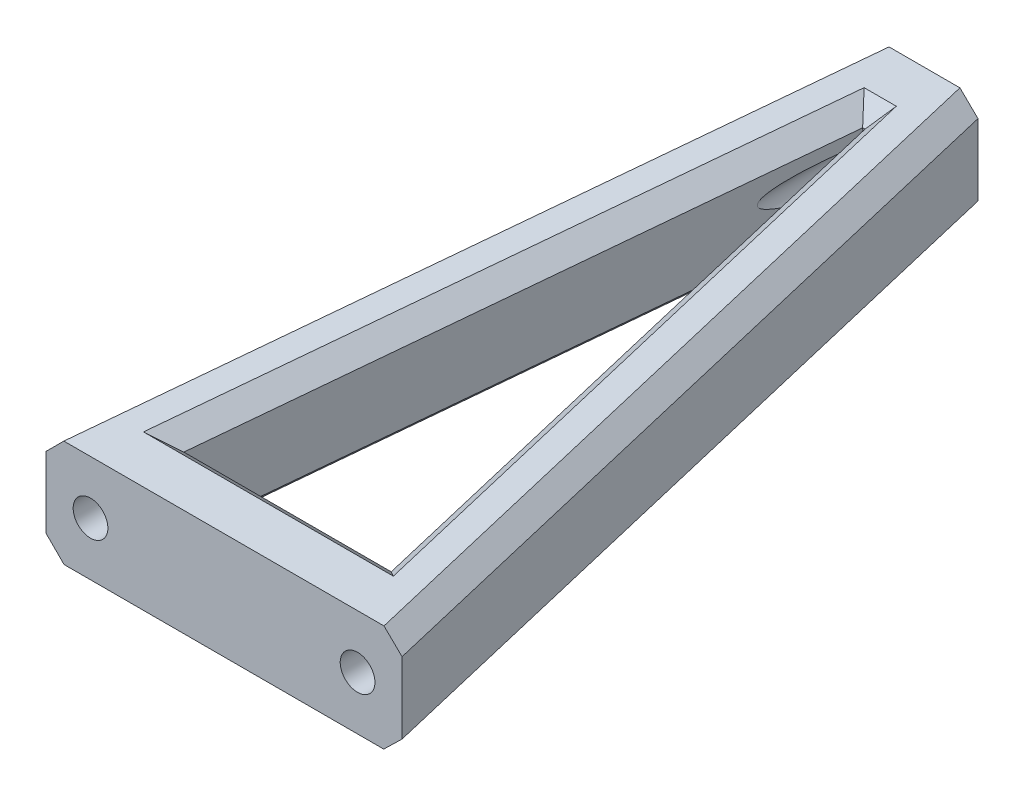
ISO-10303-21;
HEADER;
FILE_DESCRIPTION(('STEP AP214'),'2;1');
FILE_NAME('part.step','',(''),(''),'','','');
FILE_SCHEMA(('AUTOMOTIVE_DESIGN { 1 0 10303 214 1 1 1 1 }'));
ENDSEC;
DATA;
#1=APPLICATION_CONTEXT('core data for automotive mechanical design processes');
#2=APPLICATION_PROTOCOL_DEFINITION('international standard','automotive_design',2000,#1);
#3=PRODUCT_CONTEXT('',#1,'mechanical');
#4=PRODUCT('Part','Part','',(#3));
#5=PRODUCT_RELATED_PRODUCT_CATEGORY('part','',(#4));
#6=PRODUCT_DEFINITION_FORMATION('','',#4);
#7=PRODUCT_DEFINITION_CONTEXT('part definition',#1,'design');
#8=PRODUCT_DEFINITION('design','',#6,#7);
#9=PRODUCT_DEFINITION_SHAPE('','',#8);
#10=(LENGTH_UNIT() NAMED_UNIT(*) SI_UNIT(.MILLI.,.METRE.));
#11=(NAMED_UNIT(*) PLANE_ANGLE_UNIT() SI_UNIT($,.RADIAN.));
#12=(NAMED_UNIT(*) SI_UNIT($,.STERADIAN.) SOLID_ANGLE_UNIT());
#13=UNCERTAINTY_MEASURE_WITH_UNIT(LENGTH_MEASURE(1.E-05),#10,'distance_accuracy_value','');
#14=(GEOMETRIC_REPRESENTATION_CONTEXT(3) GLOBAL_UNCERTAINTY_ASSIGNED_CONTEXT((#13)) GLOBAL_UNIT_ASSIGNED_CONTEXT((#10,
#11,#12)) REPRESENTATION_CONTEXT('',''));
#15=CARTESIAN_POINT('',(0.,0.,0.));
#16=DIRECTION('',(0.,0.,1.));
#17=DIRECTION('',(1.,0.,0.));
#18=AXIS2_PLACEMENT_3D('',#15,#16,#17);
#19=CARTESIAN_POINT('',(0.,0.,78.7));
#20=DIRECTION('',(0.,0.,-1.));
#21=DIRECTION('',(-1.,0.,0.));
#22=AXIS2_PLACEMENT_3D('',#19,#20,#21);
#23=PLANE('',#22);
#24=CARTESIAN_POINT('',(15.,0.,78.7));
#25=DIRECTION('',(0.,0.,1.));
#26=DIRECTION('',(1.,0.,0.));
#27=AXIS2_PLACEMENT_3D('',#24,#25,#26);
#28=CIRCLE('',#27,1.95);
#29=CARTESIAN_POINT('',(16.95,0.,78.7));
#30=VERTEX_POINT('',#29);
#31=EDGE_CURVE('E829',#30,#30,#28,.T.);
#32=ORIENTED_EDGE('',*,*,#31,.F.);
#33=EDGE_LOOP('',(#32));
#34=FACE_BOUND('',#33,.T.);
#35=CARTESIAN_POINT('',(-15.,0.,78.7));
#36=DIRECTION('',(0.,0.,1.));
#37=DIRECTION('',(1.,0.,0.));
#38=AXIS2_PLACEMENT_3D('',#35,#36,#37);
#39=CIRCLE('',#38,1.95);
#40=CARTESIAN_POINT('',(-13.05,0.,78.7));
#41=VERTEX_POINT('',#40);
#42=EDGE_CURVE('E835',#41,#41,#39,.T.);
#43=ORIENTED_EDGE('',*,*,#42,.F.);
#44=EDGE_LOOP('',(#43));
#45=FACE_BOUND('',#44,.T.);
#46=DIRECTION('',(1.,0.,0.));
#47=VECTOR('',#46,1.);
#48=CARTESIAN_POINT('',(-20.,-6.,78.7));
#49=LINE('',#48,#47);
#50=CARTESIAN_POINT('',(-17.9687814103902,-6.,78.7));
#51=VERTEX_POINT('',#50);
#52=CARTESIAN_POINT('',(17.9411880570613,-6.,78.7));
#53=VERTEX_POINT('',#52);
#54=EDGE_CURVE('E249',#51,#53,#49,.T.);
#55=ORIENTED_EDGE('',*,*,#54,.T.);
#56=DIRECTION('',(-0.716298402373923,-0.697794094813481,0.));
#57=VECTOR('',#56,1.);
#58=CARTESIAN_POINT('',(13.6663660337412,-10.1643895258812,78.7));
#59=LINE('',#58,#57);
#60=CARTESIAN_POINT('',(20.,-3.99437383728219,78.7));
#61=VERTEX_POINT('',#60);
#62=EDGE_CURVE('E335',#53,#61,#59,.F.);
#63=ORIENTED_EDGE('',*,*,#62,.T.);
#64=DIRECTION('',(0.,1.,0.));
#65=VECTOR('',#64,1.);
#66=CARTESIAN_POINT('',(20.,-6.,78.7));
#67=LINE('',#66,#65);
#68=CARTESIAN_POINT('',(20.,4.02055260865113,78.7));
#69=VERTEX_POINT('',#68);
#70=EDGE_CURVE('E419',#61,#69,#67,.T.);
#71=ORIENTED_EDGE('',*,*,#70,.T.);
#72=DIRECTION('',(0.716174719545641,-0.697921034991583,0.));
#73=VECTOR('',#72,1.);
#74=CARTESIAN_POINT('',(9.91556076753506,13.8479621420354,78.7));
#75=LINE('',#74,#73);
#76=CARTESIAN_POINT('',(17.9687814103902,6.,78.7));
#77=VERTEX_POINT('',#76);
#78=EDGE_CURVE('E324',#69,#77,#75,.F.);
#79=ORIENTED_EDGE('',*,*,#78,.T.);
#80=DIRECTION('',(-1.,0.,0.));
#81=VECTOR('',#80,1.);
#82=CARTESIAN_POINT('',(-20.,6.,78.7));
#83=LINE('',#82,#81);
#84=CARTESIAN_POINT('',(-17.9952942311971,6.,78.7));
#85=VERTEX_POINT('',#84);
#86=EDGE_CURVE('E409',#77,#85,#83,.T.);
#87=ORIENTED_EDGE('',*,*,#86,.T.);
#88=DIRECTION('',(0.706944477552924,0.707269047574841,0.));
#89=VECTOR('',#88,1.);
#90=CARTESIAN_POINT('',(-7.78080469823353,16.2191791757811,78.7));
#91=LINE('',#90,#89);
#92=CARTESIAN_POINT('',(-20.,3.99437383728218,78.7));
#93=VERTEX_POINT('',#92);
#94=EDGE_CURVE('E326',#85,#93,#91,.F.);
#95=ORIENTED_EDGE('',*,*,#94,.T.);
#96=DIRECTION('',(0.,-1.,0.));
#97=VECTOR('',#96,1.);
#98=CARTESIAN_POINT('',(-20.,-6.,78.7));
#99=LINE('',#98,#97);
#100=CARTESIAN_POINT('',(-20.,-3.96712814760769,78.7));
#101=VERTEX_POINT('',#100);
#102=EDGE_CURVE('E320',#93,#101,#99,.T.);
#103=ORIENTED_EDGE('',*,*,#102,.T.);
#104=DIRECTION('',(-0.706819073266518,0.707394372091453,0.));
#105=VECTOR('',#104,1.);
#106=CARTESIAN_POINT('',(-15.9685198712556,-8.00188960515107,78.7));
#107=LINE('',#106,#105);
#108=EDGE_CURVE('E331',#101,#51,#107,.F.);
#109=ORIENTED_EDGE('',*,*,#108,.T.);
#110=EDGE_LOOP('',(#55,#63,#71,#79,#87,#95,#103,#109));
#111=FACE_BOUND('',#110,.T.);
#112=ADVANCED_FACE('F99',(#34,#45,#111),#23,.F.);
#113=CARTESIAN_POINT('',(0.,0.,0.));
#114=DIRECTION('',(0.,0.,1.));
#115=DIRECTION('',(1.,0.,0.));
#116=AXIS2_PLACEMENT_3D('',#113,#114,#115);
#117=PLANE('',#116);
#118=CARTESIAN_POINT('',(0.,6.,0.));
#119=DIRECTION('',(0.,0.,-1.));
#120=DIRECTION('',(-1.,0.,0.));
#121=AXIS2_PLACEMENT_3D('',#118,#119,#120);
#122=CIRCLE('',#121,1.95);
#123=CARTESIAN_POINT('',(-1.95,6.,0.));
#124=VERTEX_POINT('',#123);
#125=EDGE_CURVE('E540',#124,#124,#122,.T.);
#126=ORIENTED_EDGE('',*,*,#125,.F.);
#127=EDGE_LOOP('',(#126));
#128=FACE_BOUND('',#127,.T.);
#129=DIRECTION('',(0.,1.,0.));
#130=VECTOR('',#129,1.);
#131=CARTESIAN_POINT('',(6.,12.,0.));
#132=LINE('',#131,#130);
#133=CARTESIAN_POINT('',(6.,2.00562616271781,0.));
#134=VERTEX_POINT('',#133);
#135=CARTESIAN_POINT('',(6.,10.0205526086511,0.));
#136=VERTEX_POINT('',#135);
#137=EDGE_CURVE('E347',#134,#136,#132,.T.);
#138=ORIENTED_EDGE('',*,*,#137,.F.);
#139=DIRECTION('',(0.716298402373923,0.697794094813481,0.));
#140=VECTOR('',#139,1.);
#141=CARTESIAN_POINT('',(3.85056087934412,-0.08828598420862,0.));
#142=LINE('',#141,#140);
#143=CARTESIAN_POINT('',(3.94118805706128,0.,0.));
#144=VERTEX_POINT('',#143);
#145=EDGE_CURVE('E491',#134,#144,#142,.F.);
#146=ORIENTED_EDGE('',*,*,#145,.T.);
#147=DIRECTION('',(1.,0.,0.));
#148=VECTOR('',#147,1.);
#149=CARTESIAN_POINT('',(-6.,0.,0.));
#150=LINE('',#149,#148);
#151=CARTESIAN_POINT('',(-3.96878141039019,0.,0.));
#152=VERTEX_POINT('',#151);
#153=EDGE_CURVE('E266',#152,#144,#150,.T.);
#154=ORIENTED_EDGE('',*,*,#153,.F.);
#155=DIRECTION('',(0.706819073266518,-0.707394372091453,0.));
#156=VECTOR('',#155,1.);
#157=CARTESIAN_POINT('',(-5.96282569682862,1.99566729206779,0.));
#158=LINE('',#157,#156);
#159=CARTESIAN_POINT('',(-6.,2.0328718523923,0.));
#160=VERTEX_POINT('',#159);
#161=EDGE_CURVE('E487',#152,#160,#158,.F.);
#162=ORIENTED_EDGE('',*,*,#161,.T.);
#163=DIRECTION('',(0.,-1.,0.));
#164=VECTOR('',#163,1.);
#165=CARTESIAN_POINT('',(-6.,12.,0.));
#166=LINE('',#165,#164);
#167=CARTESIAN_POINT('',(-6.,9.99437383728218,0.));
#168=VERTEX_POINT('',#167);
#169=EDGE_CURVE('E456',#168,#160,#166,.T.);
#170=ORIENTED_EDGE('',*,*,#169,.F.);
#171=DIRECTION('',(-0.706944477552924,-0.707269047574841,0.));
#172=VECTOR('',#171,1.);
#173=CARTESIAN_POINT('',(-3.77759130299252,12.2178028792565,0.));
#174=LINE('',#173,#172);
#175=CARTESIAN_POINT('',(-3.99529423119708,12.,0.));
#176=VERTEX_POINT('',#175);
#177=EDGE_CURVE('E482',#168,#176,#174,.F.);
#178=ORIENTED_EDGE('',*,*,#177,.T.);
#179=DIRECTION('',(-1.,0.,0.));
#180=VECTOR('',#179,1.);
#181=CARTESIAN_POINT('',(-6.,12.,0.));
#182=LINE('',#181,#180);
#183=CARTESIAN_POINT('',(3.96878141039018,12.,0.));
#184=VERTEX_POINT('',#183);
#185=EDGE_CURVE('E460',#184,#176,#182,.T.);
#186=ORIENTED_EDGE('',*,*,#185,.F.);
#187=DIRECTION('',(-0.716174719545641,0.697921034991583,0.));
#188=VECTOR('',#187,1.);
#189=CARTESIAN_POINT('',(6.09524838136356,9.92773189453167,0.));
#190=LINE('',#189,#188);
#191=EDGE_CURVE('E424',#184,#136,#190,.F.);
#192=ORIENTED_EDGE('',*,*,#191,.T.);
#193=EDGE_LOOP('',(#138,#146,#154,#162,#170,#178,#186,#192));
#194=FACE_BOUND('',#193,.T.);
#195=ADVANCED_FACE('F374',(#128,#194),#117,.F.);
#196=CARTESIAN_POINT('',(6.,12.,0.));
#197=DIRECTION('',(0.,0.997106424250026,0.0760182788500655));
#198=DIRECTION('',(-1.,0.,0.));
#199=AXIS2_PLACEMENT_3D('',#196,#197,#198);
#200=PLANE('',#199);
#201=DIRECTION('',(0.174649823402375,-0.0748499243153034,0.981781507269063));
#202=VECTOR('',#201,1.);
#203=CARTESIAN_POINT('',(13.618364269534,6.55868110990349,71.3719661084325));
#204=LINE('',#203,#202);
#205=CARTESIAN_POINT('',(1.80883344589291,11.6199086057497,4.98553212125014));
#206=VERTEX_POINT('',#205);
#207=CARTESIAN_POINT('',(14.035073606058,6.38009139425033,73.7144678787499));
#208=VERTEX_POINT('',#207);
#209=EDGE_CURVE('E117',#206,#208,#204,.T.);
#210=ORIENTED_EDGE('',*,*,#209,.T.);
#211=DIRECTION('',(-1.,0.,0.));
#212=VECTOR('',#211,1.);
#213=CARTESIAN_POINT('',(-11.6491030484813,6.38009139425033,73.7144678787499));
#214=LINE('',#213,#212);
#215=CARTESIAN_POINT('',(-14.035073606058,6.38009139425033,73.7144678787499));
#216=VERTEX_POINT('',#215);
#217=EDGE_CURVE('E425',#208,#216,#214,.T.);
#218=ORIENTED_EDGE('',*,*,#217,.T.);
#219=DIRECTION('',(0.174649823402374,0.0748499243153034,-0.981781507269063));
#220=VECTOR('',#219,1.);
#221=CARTESIAN_POINT('',(-2.10162804530281,11.4944252060026,6.63145604793291));
#222=LINE('',#221,#220);
#223=CARTESIAN_POINT('',(-1.80883344589291,11.6199086057497,4.98553212125014));
#224=VERTEX_POINT('',#223);
#225=EDGE_CURVE('E521',#216,#224,#222,.T.);
#226=ORIENTED_EDGE('',*,*,#225,.T.);
#227=DIRECTION('',(1.,0.,0.));
#228=VECTOR('',#227,1.);
#229=CARTESIAN_POINT('',(0.13236682425009,11.6199086057497,4.98553212125014));
#230=LINE('',#229,#228);
#231=EDGE_CURVE('E517',#224,#206,#230,.T.);
#232=ORIENTED_EDGE('',*,*,#231,.T.);
#233=EDGE_LOOP('',(#210,#218,#226,#232));
#234=FACE_BOUND('',#233,.T.);
#235=ORIENTED_EDGE('',*,*,#185,.T.);
#236=DIRECTION('',(-0.174649823402374,-0.0748499243153034,0.981781507269063));
#237=VECTOR('',#236,1.);
#238=CARTESIAN_POINT('',(-3.69041216105136,12.1306637443482,-1.71387278003342));
#239=LINE('',#238,#237);
#240=EDGE_CURVE('E109',#176,#85,#239,.T.);
#241=ORIENTED_EDGE('',*,*,#240,.T.);
#242=ORIENTED_EDGE('',*,*,#86,.F.);
#243=DIRECTION('',(-0.174649823402375,0.0748499243153034,-0.981781507269063));
#244=VECTOR('',#243,1.);
#245=CARTESIAN_POINT('',(4.03073877894725,11.973446842047,0.348288921817284));
#246=LINE('',#245,#244);
#247=EDGE_CURVE('E416',#77,#184,#246,.T.);
#248=ORIENTED_EDGE('',*,*,#247,.T.);
#249=EDGE_LOOP('',(#235,#241,#242,#248));
#250=FACE_BOUND('',#249,.T.);
#251=ADVANCED_FACE('F365',(#234,#250),#200,.T.);
#252=CARTESIAN_POINT('',(6.,0.,0.));
#253=DIRECTION('',(0.984543338525678,0.,-0.175141127564924));
#254=DIRECTION('',(0.,1.,0.));
#255=AXIS2_PLACEMENT_3D('',#252,#253,#254);
#256=PLANE('',#255);
#257=ORIENTED_EDGE('',*,*,#70,.F.);
#258=DIRECTION('',(-0.174649823402375,0.0748499243153034,-0.981781507269063));
#259=VECTOR('',#258,1.);
#260=CARTESIAN_POINT('',(6.02621860028546,1.99438961973833,0.147385988747567));
#261=LINE('',#260,#259);
#262=EDGE_CURVE('E483',#61,#134,#261,.T.);
#263=ORIENTED_EDGE('',*,*,#262,.T.);
#264=ORIENTED_EDGE('',*,*,#137,.T.);
#265=DIRECTION('',(0.174649823402375,-0.0748499243153034,0.981781507269063));
#266=VECTOR('',#265,1.);
#267=CARTESIAN_POINT('',(6.13099393514575,9.96441235073152,0.736373049712181));
#268=LINE('',#267,#266);
#269=EDGE_CURVE('E339',#136,#69,#268,.T.);
#270=ORIENTED_EDGE('',*,*,#269,.T.);
#271=EDGE_LOOP('',(#257,#263,#264,#270));
#272=FACE_BOUND('',#271,.T.);
#273=ADVANCED_FACE('F292',(#272),#256,.T.);
#274=CARTESIAN_POINT('',(-6.,0.,0.));
#275=DIRECTION('',(0.,-0.997106424250026,-0.0760182788500655));
#276=DIRECTION('',(1.,0.,0.));
#277=AXIS2_PLACEMENT_3D('',#274,#275,#276);
#278=PLANE('',#277);
#279=DIRECTION('',(-0.174649823402375,0.0748499243153034,-0.981781507269063));
#280=VECTOR('',#279,1.);
#281=CARTESIAN_POINT('',(2.10162804530281,-0.436229449365509,5.72187627751093));
#282=LINE('',#281,#280);
#283=CARTESIAN_POINT('',(14.0350736060581,-5.55056326111775,72.8048881083279));
#284=VERTEX_POINT('',#283);
#285=CARTESIAN_POINT('',(1.80883344589292,-0.310746049618412,4.07595235082816));
#286=VERTEX_POINT('',#285);
#287=EDGE_CURVE('E550',#284,#286,#282,.T.);
#288=ORIENTED_EDGE('',*,*,#287,.T.);
#289=DIRECTION('',(-1.,0.,0.));
#290=VECTOR('',#289,1.);
#291=CARTESIAN_POINT('',(-0.132366824250091,-0.310746049618412,4.07595235082816));
#292=LINE('',#291,#290);
#293=CARTESIAN_POINT('',(-1.80883344589292,-0.310746049618412,4.07595235082816));
#294=VERTEX_POINT('',#293);
#295=EDGE_CURVE('E547',#286,#294,#292,.T.);
#296=ORIENTED_EDGE('',*,*,#295,.T.);
#297=DIRECTION('',(-0.174649823402374,-0.0748499243153034,0.981781507269063));
#298=VECTOR('',#297,1.);
#299=CARTESIAN_POINT('',(-13.618364269534,-5.37197354546459,70.4623863380106));
#300=LINE('',#299,#298);
#301=CARTESIAN_POINT('',(-14.0350736060581,-5.55056326111776,72.8048881083279));
#302=VERTEX_POINT('',#301);
#303=EDGE_CURVE('E554',#294,#302,#300,.T.);
#304=ORIENTED_EDGE('',*,*,#303,.T.);
#305=DIRECTION('',(1.,0.,0.));
#306=VECTOR('',#305,1.);
#307=CARTESIAN_POINT('',(11.6491030484813,-5.55056326111776,72.8048881083279));
#308=LINE('',#307,#306);
#309=EDGE_CURVE('E552',#302,#284,#308,.T.);
#310=ORIENTED_EDGE('',*,*,#309,.T.);
#311=EDGE_LOOP('',(#288,#296,#304,#310));
#312=FACE_BOUND('',#311,.T.);
#313=ORIENTED_EDGE('',*,*,#153,.T.);
#314=DIRECTION('',(0.174649823402375,-0.0748499243153034,0.981781507269063));
#315=VECTOR('',#314,1.);
#316=CARTESIAN_POINT('',(3.63795636378258,0.129956439976586,-1.70459530435955));
#317=LINE('',#316,#315);
#318=EDGE_CURVE('E327',#144,#53,#317,.T.);
#319=ORIENTED_EDGE('',*,*,#318,.T.);
#320=ORIENTED_EDGE('',*,*,#54,.F.);
#321=DIRECTION('',(0.174649823402374,0.0748499243153034,-0.981781507269063));
#322=VECTOR('',#321,1.);
#323=CARTESIAN_POINT('',(-4.03073877894727,-0.0265531579530336,0.348288921817281));
#324=LINE('',#323,#322);
#325=EDGE_CURVE('E259',#51,#152,#324,.T.);
#326=ORIENTED_EDGE('',*,*,#325,.T.);
#327=EDGE_LOOP('',(#313,#319,#320,#326));
#328=FACE_BOUND('',#327,.T.);
#329=ADVANCED_FACE('F282',(#312,#328),#278,.T.);
#330=CARTESIAN_POINT('',(-6.,12.,0.));
#331=DIRECTION('',(-0.984543338525678,0.,-0.175141127564924));
#332=DIRECTION('',(0.,-1.,0.));
#333=AXIS2_PLACEMENT_3D('',#330,#331,#332);
#334=PLANE('',#333);
#335=ORIENTED_EDGE('',*,*,#169,.T.);
#336=DIRECTION('',(-0.174649823402374,-0.0748499243153034,0.981781507269063));
#337=VECTOR('',#336,1.);
#338=CARTESIAN_POINT('',(-5.86970445751366,2.08871279917216,-0.732447085262493));
#339=LINE('',#338,#337);
#340=EDGE_CURVE('E513',#160,#101,#339,.T.);
#341=ORIENTED_EDGE('',*,*,#340,.T.);
#342=ORIENTED_EDGE('',*,*,#102,.F.);
#343=DIRECTION('',(0.174649823402374,0.0748499243153034,-0.981781507269063));
#344=VECTOR('',#343,1.);
#345=CARTESIAN_POINT('',(-5.97378139971454,10.0056103802617,-0.147385988747567));
#346=LINE('',#345,#344);
#347=EDGE_CURVE('E511',#93,#168,#346,.T.);
#348=ORIENTED_EDGE('',*,*,#347,.T.);
#349=EDGE_LOOP('',(#335,#341,#342,#348));
#350=FACE_BOUND('',#349,.T.);
#351=ADVANCED_FACE('F291',(#350),#334,.T.);
#352=CARTESIAN_POINT('',(0.,6.,20.));
#353=DIRECTION('',(0.,0.,-1.));
#354=DIRECTION('',(-1.,0.,0.));
#355=AXIS2_PLACEMENT_3D('',#352,#353,#354);
#356=CYLINDRICAL_SURFACE('',#355,1.95);
#357=CARTESIAN_POINT('',(0.,6.,6.56288051881883));
#358=DIRECTION('',(0.,0.0760182788500656,-0.997106424250026));
#359=DIRECTION('',(0.,-0.997106424250026,-0.0760182788500656));
#360=AXIS2_PLACEMENT_3D('',#357,#358,#359);
#361=ELLIPSE('',#360,1.95565884701494,1.95);
#362=CARTESIAN_POINT('',(0.13236682425009,7.94550225490436,6.71120343532997));
#363=VERTEX_POINT('',#362);
#364=CARTESIAN_POINT('',(-0.132366824250091,7.94550225490435,6.71120343532997));
#365=VERTEX_POINT('',#364);
#366=EDGE_CURVE('E254',#363,#365,#361,.F.);
#367=ORIENTED_EDGE('',*,*,#366,.T.);
#368=CARTESIAN_POINT('',(0.,6.,5.81446494306774));
#369=DIRECTION('',(-0.984630610526363,0.0132765789765164,-0.17414446090864));
#370=DIRECTION('',(0.17412863217561,-0.00234791861276423,-0.98472011593896));
#371=AXIS2_PLACEMENT_3D('',#368,#369,#370);
#372=ELLIPSE('',#371,11.1975999111623,1.95);
#373=CARTESIAN_POINT('',(-0.132366824250091,4.05449774509564,6.4145576023077));
#374=VERTEX_POINT('',#373);
#375=EDGE_CURVE('E253',#365,#374,#372,.F.);
#376=ORIENTED_EDGE('',*,*,#375,.T.);
#377=CARTESIAN_POINT('',(0.13236682425009,4.05449774509564,6.4145576023077));
#378=VERTEX_POINT('',#377);
#379=EDGE_CURVE('E234',#374,#378,#361,.F.);
#380=ORIENTED_EDGE('',*,*,#379,.T.);
#381=CARTESIAN_POINT('',(0.,6.,5.81446494306775));
#382=DIRECTION('',(0.984630610526363,0.0132765789765164,-0.17414446090864));
#383=DIRECTION('',(-0.17412863217561,-0.00234791861276423,-0.98472011593896));
#384=AXIS2_PLACEMENT_3D('',#381,#382,#383);
#385=ELLIPSE('',#384,11.1975999111623,1.95);
#386=EDGE_CURVE('E243',#378,#363,#385,.F.);
#387=ORIENTED_EDGE('',*,*,#386,.T.);
#388=EDGE_LOOP('',(#367,#376,#380,#387));
#389=FACE_BOUND('',#388,.T.);
#390=ORIENTED_EDGE('',*,*,#125,.T.);
#391=EDGE_LOOP('',(#390));
#392=FACE_BOUND('',#391,.T.);
#393=ADVANCED_FACE('F251',(#389,#392),#356,.F.);
#394=CARTESIAN_POINT('',(-15.,0.,68.7));
#395=DIRECTION('',(0.,0.,1.));
#396=DIRECTION('',(1.,0.,0.));
#397=AXIS2_PLACEMENT_3D('',#394,#395,#396);
#398=CYLINDRICAL_SURFACE('',#397,1.95);
#399=CARTESIAN_POINT('',(-15.,0.,68.7));
#400=DIRECTION('',(0.,0.,1.));
#401=DIRECTION('',(1.,0.,0.));
#402=AXIS2_PLACEMENT_3D('',#399,#400,#401);
#403=CIRCLE('',#402,1.95);
#404=CARTESIAN_POINT('',(-13.05,0.,68.7));
#405=VERTEX_POINT('',#404);
#406=EDGE_CURVE('E832',#405,#405,#403,.T.);
#407=ORIENTED_EDGE('',*,*,#406,.F.);
#408=EDGE_LOOP('',(#407));
#409=FACE_BOUND('',#408,.T.);
#410=ORIENTED_EDGE('',*,*,#42,.T.);
#411=EDGE_LOOP('',(#410));
#412=FACE_BOUND('',#411,.T.);
#413=ADVANCED_FACE('F782',(#409,#412),#398,.F.);
#414=CARTESIAN_POINT('',(-15.,0.,68.7));
#415=DIRECTION('',(0.,0.,1.));
#416=DIRECTION('',(1.,0.,0.));
#417=AXIS2_PLACEMENT_3D('',#414,#415,#416);
#418=PLANE('',#417);
#419=ORIENTED_EDGE('',*,*,#406,.T.);
#420=EDGE_LOOP('',(#419));
#421=FACE_BOUND('',#420,.T.);
#422=ADVANCED_FACE('F773',(#421),#418,.T.);
#423=CARTESIAN_POINT('',(15.,0.,68.7));
#424=DIRECTION('',(0.,0.,1.));
#425=DIRECTION('',(1.,0.,0.));
#426=AXIS2_PLACEMENT_3D('',#423,#424,#425);
#427=CYLINDRICAL_SURFACE('',#426,1.95);
#428=CARTESIAN_POINT('',(15.,0.,68.7));
#429=DIRECTION('',(0.,0.,1.));
#430=DIRECTION('',(1.,0.,0.));
#431=AXIS2_PLACEMENT_3D('',#428,#429,#430);
#432=CIRCLE('',#431,1.95);
#433=CARTESIAN_POINT('',(16.95,0.,68.7));
#434=VERTEX_POINT('',#433);
#435=EDGE_CURVE('E827',#434,#434,#432,.T.);
#436=ORIENTED_EDGE('',*,*,#435,.F.);
#437=EDGE_LOOP('',(#436));
#438=FACE_BOUND('',#437,.T.);
#439=ORIENTED_EDGE('',*,*,#31,.T.);
#440=EDGE_LOOP('',(#439));
#441=FACE_BOUND('',#440,.T.);
#442=ADVANCED_FACE('F764',(#438,#441),#427,.F.);
#443=CARTESIAN_POINT('',(15.,0.,68.7));
#444=DIRECTION('',(0.,0.,1.));
#445=DIRECTION('',(1.,0.,0.));
#446=AXIS2_PLACEMENT_3D('',#443,#444,#445);
#447=PLANE('',#446);
#448=ORIENTED_EDGE('',*,*,#435,.T.);
#449=EDGE_LOOP('',(#448));
#450=FACE_BOUND('',#449,.T.);
#451=ADVANCED_FACE('F614',(#450),#447,.T.);
#452=CARTESIAN_POINT('',(-0.132366824250091,-6.42821693695614,5.61536715640795));
#453=DIRECTION('',(-0.984630610526363,0.0132765789765164,-0.17414446090864));
#454=DIRECTION('',(-0.174159810946631,0.,0.98471740121267));
#455=AXIS2_PLACEMENT_3D('',#452,#453,#454);
#456=PLANE('',#455);
#457=DIRECTION('',(0.,0.997106424250026,0.0760182788500656));
#458=VECTOR('',#457,1.);
#459=CARTESIAN_POINT('',(-11.6491030484813,-11.3639610330552,70.3558772169076));
#460=LINE('',#459,#458);
#461=CARTESIAN_POINT('',(-11.6491030484813,-3.40431385491756,70.962711817528));
#462=VERTEX_POINT('',#461);
#463=CARTESIAN_POINT('',(-11.6491030484813,4.53791510345043,71.5682184725497));
#464=VERTEX_POINT('',#463);
#465=EDGE_CURVE('E836',#462,#464,#460,.T.);
#466=ORIENTED_EDGE('',*,*,#465,.F.);
#467=DIRECTION('',(0.174649823402374,0.0748499243153034,-0.981781507269063));
#468=VECTOR('',#467,1.);
#469=CARTESIAN_POINT('',(-0.132366824250091,1.53143024118152,6.22220175702835));
#470=LINE('',#469,#468);
#471=CARTESIAN_POINT('',(-0.132366824250091,1.53143024118152,6.22220175702835));
#472=VERTEX_POINT('',#471);
#473=EDGE_CURVE('E509',#462,#472,#470,.T.);
#474=ORIENTED_EDGE('',*,*,#473,.T.);
#475=DIRECTION('',(0.,0.997106424250026,0.0760182788500656));
#476=VECTOR('',#475,1.);
#477=CARTESIAN_POINT('',(-0.132366824250091,-6.42821693695614,5.61536715640795));
#478=LINE('',#477,#476);
#479=EDGE_CURVE('E845',#472,#374,#478,.T.);
#480=ORIENTED_EDGE('',*,*,#479,.T.);
#481=ORIENTED_EDGE('',*,*,#375,.F.);
#482=CARTESIAN_POINT('',(-0.132366824250091,9.47365919954952,6.82770841205006));
#483=VERTEX_POINT('',#482);
#484=EDGE_CURVE('E239',#365,#483,#478,.T.);
#485=ORIENTED_EDGE('',*,*,#484,.T.);
#486=DIRECTION('',(-0.174649823402374,-0.0748499243153034,0.981781507269063));
#487=VECTOR('',#486,1.);
#488=CARTESIAN_POINT('',(-11.6491030484813,4.53791510345043,71.5682184725497));
#489=LINE('',#488,#487);
#490=EDGE_CURVE('E507',#483,#464,#489,.T.);
#491=ORIENTED_EDGE('',*,*,#490,.T.);
#492=EDGE_LOOP('',(#466,#474,#480,#481,#485,#491));
#493=FACE_BOUND('',#492,.T.);
#494=ADVANCED_FACE('F609',(#493),#456,.F.);
#495=CARTESIAN_POINT('',(0.13236682425009,-6.42821693695614,5.61536715640795));
#496=DIRECTION('',(0.,0.0760182788500656,-0.997106424250026));
#497=DIRECTION('',(0.,0.997106424250026,0.0760182788500656));
#498=AXIS2_PLACEMENT_3D('',#495,#496,#497);
#499=PLANE('',#498);
#500=DIRECTION('',(0.,0.997106424250026,0.0760182788500656));
#501=VECTOR('',#500,1.);
#502=CARTESIAN_POINT('',(0.13236682425009,-6.42821693695614,5.61536715640795));
#503=LINE('',#502,#501);
#504=CARTESIAN_POINT('',(0.13236682425009,9.47365919954952,6.82770841205006));
#505=VERTEX_POINT('',#504);
#506=EDGE_CURVE('E240',#363,#505,#503,.T.);
#507=ORIENTED_EDGE('',*,*,#506,.T.);
#508=DIRECTION('',(-1.,0.,0.));
#509=VECTOR('',#508,1.);
#510=CARTESIAN_POINT('',(-0.132366824250091,9.47365919954952,6.82770841205006));
#511=LINE('',#510,#509);
#512=EDGE_CURVE('E13',#505,#483,#511,.T.);
#513=ORIENTED_EDGE('',*,*,#512,.T.);
#514=ORIENTED_EDGE('',*,*,#484,.F.);
#515=ORIENTED_EDGE('',*,*,#366,.F.);
#516=EDGE_LOOP('',(#507,#513,#514,#515));
#517=FACE_BOUND('',#516,.T.);
#518=ADVANCED_FACE('F613',(#517),#499,.F.);
#519=ORIENTED_EDGE('',*,*,#479,.F.);
#520=DIRECTION('',(1.,0.,0.));
#521=VECTOR('',#520,1.);
#522=CARTESIAN_POINT('',(0.13236682425009,1.53143024118152,6.22220175702835));
#523=LINE('',#522,#521);
#524=CARTESIAN_POINT('',(0.13236682425009,1.53143024118152,6.22220175702835));
#525=VERTEX_POINT('',#524);
#526=EDGE_CURVE('E237',#472,#525,#523,.T.);
#527=ORIENTED_EDGE('',*,*,#526,.T.);
#528=EDGE_CURVE('E229',#525,#378,#503,.T.);
#529=ORIENTED_EDGE('',*,*,#528,.T.);
#530=ORIENTED_EDGE('',*,*,#379,.F.);
#531=EDGE_LOOP('',(#519,#527,#529,#530));
#532=FACE_BOUND('',#531,.T.);
#533=ADVANCED_FACE('F232',(#532),#499,.F.);
#534=CARTESIAN_POINT('',(11.6491030484813,-11.3639610330552,70.3558772169076));
#535=DIRECTION('',(0.984630610526363,0.0132765789765164,-0.17414446090864));
#536=DIRECTION('',(-0.174159810946631,0.,-0.98471740121267));
#537=AXIS2_PLACEMENT_3D('',#534,#535,#536);
#538=PLANE('',#537);
#539=ORIENTED_EDGE('',*,*,#528,.F.);
#540=DIRECTION('',(0.174649823402375,-0.0748499243153034,0.981781507269063));
#541=VECTOR('',#540,1.);
#542=CARTESIAN_POINT('',(11.6491030484813,-3.40431385491756,70.962711817528));
#543=LINE('',#542,#541);
#544=CARTESIAN_POINT('',(11.6491030484813,-3.40431385491756,70.962711817528));
#545=VERTEX_POINT('',#544);
#546=EDGE_CURVE('E500',#525,#545,#543,.T.);
#547=ORIENTED_EDGE('',*,*,#546,.T.);
#548=DIRECTION('',(0.,0.997106424250026,0.0760182788500656));
#549=VECTOR('',#548,1.);
#550=CARTESIAN_POINT('',(11.6491030484813,-11.3639610330552,70.3558772169076));
#551=LINE('',#550,#549);
#552=CARTESIAN_POINT('',(11.6491030484813,4.53791510345044,71.5682184725497));
#553=VERTEX_POINT('',#552);
#554=EDGE_CURVE('E445',#545,#553,#551,.T.);
#555=ORIENTED_EDGE('',*,*,#554,.T.);
#556=DIRECTION('',(-0.174649823402375,0.0748499243153034,-0.981781507269063));
#557=VECTOR('',#556,1.);
#558=CARTESIAN_POINT('',(0.132366824250093,9.47365919954952,6.82770841205006));
#559=LINE('',#558,#557);
#560=EDGE_CURVE('E498',#553,#505,#559,.T.);
#561=ORIENTED_EDGE('',*,*,#560,.T.);
#562=ORIENTED_EDGE('',*,*,#506,.F.);
#563=ORIENTED_EDGE('',*,*,#386,.F.);
#564=EDGE_LOOP('',(#539,#547,#555,#561,#562,#563));
#565=FACE_BOUND('',#564,.T.);
#566=ADVANCED_FACE('F244',(#565),#538,.F.);
#567=CARTESIAN_POINT('',(-11.6491030484813,-11.3639610330552,70.3558772169076));
#568=DIRECTION('',(0.,-0.0760182788500656,0.997106424250026));
#569=DIRECTION('',(0.,-0.997106424250026,-0.0760182788500656));
#570=AXIS2_PLACEMENT_3D('',#567,#568,#569);
#571=PLANE('',#570);
#572=ORIENTED_EDGE('',*,*,#554,.F.);
#573=DIRECTION('',(-1.,0.,0.));
#574=VECTOR('',#573,1.);
#575=CARTESIAN_POINT('',(-11.6491030484813,-3.40431385491757,70.962711817528));
#576=LINE('',#575,#574);
#577=EDGE_CURVE('E505',#545,#462,#576,.T.);
#578=ORIENTED_EDGE('',*,*,#577,.T.);
#579=ORIENTED_EDGE('',*,*,#465,.T.);
#580=DIRECTION('',(1.,0.,0.));
#581=VECTOR('',#580,1.);
#582=CARTESIAN_POINT('',(11.6491030484813,4.53791510345043,71.5682184725497));
#583=LINE('',#582,#581);
#584=EDGE_CURVE('E502',#464,#553,#583,.T.);
#585=ORIENTED_EDGE('',*,*,#584,.T.);
#586=EDGE_LOOP('',(#572,#578,#579,#585));
#587=FACE_BOUND('',#586,.T.);
#588=ADVANCED_FACE('F638',(#587),#571,.F.);
#589=CARTESIAN_POINT('',(3.63795636378258,0.129956439976586,-1.70459530435955));
#590=DIRECTION('',(-0.686907596016015,0.705123212222514,0.17595229501346));
#591=DIRECTION('',(0.174649823402375,-0.0748499243153033,0.981781507269063));
#592=AXIS2_PLACEMENT_3D('',#589,#590,#591);
#593=PLANE('',#592);
#594=ORIENTED_EDGE('',*,*,#145,.F.);
#595=ORIENTED_EDGE('',*,*,#262,.F.);
#596=ORIENTED_EDGE('',*,*,#62,.F.);
#597=ORIENTED_EDGE('',*,*,#318,.F.);
#598=EDGE_LOOP('',(#594,#595,#596,#597));
#599=FACE_BOUND('',#598,.T.);
#600=ADVANCED_FACE('F302',(#599),#593,.F.);
#601=CARTESIAN_POINT('',(-11.6491030484813,-3.40431385491756,70.962711817528));
#602=DIRECTION('',(0.,-0.651307673682852,-0.758813754620876));
#603=DIRECTION('',(1.,0.,0.));
#604=AXIS2_PLACEMENT_3D('',#601,#602,#603);
#605=PLANE('',#604);
#606=DIRECTION('',(0.644789664869761,-0.580006920435865,0.497833566891231));
#607=VECTOR('',#606,1.);
#608=CARTESIAN_POINT('',(11.6491030484813,-3.40431385491756,70.962711817528));
#609=LINE('',#608,#607);
#610=EDGE_CURVE('E439',#284,#545,#609,.F.);
#611=ORIENTED_EDGE('',*,*,#610,.F.);
#612=ORIENTED_EDGE('',*,*,#309,.F.);
#613=DIRECTION('',(-0.644789664869761,-0.580006920435865,0.497833566891231));
#614=VECTOR('',#613,1.);
#615=CARTESIAN_POINT('',(-11.6491030484813,-3.40431385491756,70.962711817528));
#616=LINE('',#615,#614);
#617=EDGE_CURVE('E442',#462,#302,#616,.T.);
#618=ORIENTED_EDGE('',*,*,#617,.F.);
#619=ORIENTED_EDGE('',*,*,#577,.F.);
#620=EDGE_LOOP('',(#611,#612,#618,#619));
#621=FACE_BOUND('',#620,.T.);
#622=ADVANCED_FACE('F654',(#621),#605,.T.);
#623=CARTESIAN_POINT('',(-0.132366824250091,1.53143024118152,6.22220175702835));
#624=DIRECTION('',(0.696238981667045,-0.714448673177115,0.0693856887455645));
#625=DIRECTION('',(-0.174649823402374,-0.0748499243153034,0.981781507269063));
#626=AXIS2_PLACEMENT_3D('',#623,#624,#625);
#627=PLANE('',#626);
#628=ORIENTED_EDGE('',*,*,#617,.T.);
#629=ORIENTED_EDGE('',*,*,#303,.F.);
#630=DIRECTION('',(0.509883795941444,0.560283054741615,0.652764439293186));
#631=VECTOR('',#630,1.);
#632=CARTESIAN_POINT('',(-0.0635409770872742,1.60705915153425,6.31031411888359));
#633=LINE('',#632,#631);
#634=EDGE_CURVE('E437',#472,#294,#633,.F.);
#635=ORIENTED_EDGE('',*,*,#634,.F.);
#636=ORIENTED_EDGE('',*,*,#473,.F.);
#637=EDGE_LOOP('',(#628,#629,#635,#636));
#638=FACE_BOUND('',#637,.T.);
#639=ADVANCED_FACE('F662',(#638),#627,.T.);
#640=CARTESIAN_POINT('',(11.6491030484813,-3.40431385491756,70.962711817528));
#641=DIRECTION('',(-0.696238981667045,-0.714448673177115,0.0693856887455647));
#642=DIRECTION('',(-0.174649823402375,0.0748499243153034,-0.981781507269063));
#643=AXIS2_PLACEMENT_3D('',#640,#641,#642);
#644=PLANE('',#643);
#645=ORIENTED_EDGE('',*,*,#610,.T.);
#646=ORIENTED_EDGE('',*,*,#546,.F.);
#647=DIRECTION('',(0.509883795941444,-0.560283054741616,-0.652764439293186));
#648=VECTOR('',#647,1.);
#649=CARTESIAN_POINT('',(0.13236682425009,1.53143024118152,6.22220175702835));
#650=LINE('',#649,#648);
#651=EDGE_CURVE('E435',#286,#525,#650,.F.);
#652=ORIENTED_EDGE('',*,*,#651,.F.);
#653=ORIENTED_EDGE('',*,*,#287,.F.);
#654=EDGE_LOOP('',(#645,#646,#652,#653));
#655=FACE_BOUND('',#654,.T.);
#656=ADVANCED_FACE('F671',(#655),#644,.T.);
#657=CARTESIAN_POINT('',(0.13236682425009,1.53143024118152,6.22220175702835));
#658=DIRECTION('',(0.,-0.758813754620874,0.651307673682855));
#659=DIRECTION('',(-1.,0.,0.));
#660=AXIS2_PLACEMENT_3D('',#657,#658,#659);
#661=PLANE('',#660);
#662=ORIENTED_EDGE('',*,*,#634,.T.);
#663=ORIENTED_EDGE('',*,*,#295,.F.);
#664=ORIENTED_EDGE('',*,*,#651,.T.);
#665=ORIENTED_EDGE('',*,*,#526,.F.);
#666=EDGE_LOOP('',(#662,#663,#664,#665));
#667=FACE_BOUND('',#666,.T.);
#668=ADVANCED_FACE('F680',(#667),#661,.T.);
#669=CARTESIAN_POINT('',(-5.86970445751366,2.08871279917216,-0.732447085262493));
#670=DIRECTION('',(0.69623898166704,0.695672755126613,0.176891769683586));
#671=DIRECTION('',(-0.174649823402374,-0.0748499243153034,0.981781507269063));
#672=AXIS2_PLACEMENT_3D('',#669,#670,#671);
#673=PLANE('',#672);
#674=ORIENTED_EDGE('',*,*,#161,.F.);
#675=ORIENTED_EDGE('',*,*,#325,.F.);
#676=ORIENTED_EDGE('',*,*,#108,.F.);
#677=ORIENTED_EDGE('',*,*,#340,.F.);
#678=EDGE_LOOP('',(#674,#675,#676,#677));
#679=FACE_BOUND('',#678,.T.);
#680=ADVANCED_FACE('F564',(#679),#673,.F.);
#681=CARTESIAN_POINT('',(-3.69041216105137,12.1306637443482,-1.71387278003342));
#682=DIRECTION('',(0.705446946071085,-0.705123212222513,0.0717346629181717));
#683=DIRECTION('',(-0.174649823402374,-0.0748499243153034,0.981781507269063));
#684=AXIS2_PLACEMENT_3D('',#681,#682,#683);
#685=PLANE('',#684);
#686=ORIENTED_EDGE('',*,*,#177,.F.);
#687=ORIENTED_EDGE('',*,*,#347,.F.);
#688=ORIENTED_EDGE('',*,*,#94,.F.);
#689=ORIENTED_EDGE('',*,*,#240,.F.);
#690=EDGE_LOOP('',(#686,#687,#688,#689));
#691=FACE_BOUND('',#690,.T.);
#692=ADVANCED_FACE('F696',(#691),#685,.F.);
#693=CARTESIAN_POINT('',(6.13099393514575,9.96441235073152,0.736373049712181));
#694=DIRECTION('',(-0.696238981667042,-0.714448673177118,0.069385688745564));
#695=DIRECTION('',(0.174649823402375,-0.0748499243153034,0.981781507269063));
#696=AXIS2_PLACEMENT_3D('',#693,#694,#695);
#697=PLANE('',#696);
#698=ORIENTED_EDGE('',*,*,#191,.F.);
#699=ORIENTED_EDGE('',*,*,#247,.F.);
#700=ORIENTED_EDGE('',*,*,#78,.F.);
#701=ORIENTED_EDGE('',*,*,#269,.F.);
#702=EDGE_LOOP('',(#698,#699,#700,#701));
#703=FACE_BOUND('',#702,.T.);
#704=ADVANCED_FACE('F423',(#703),#697,.F.);
#705=CARTESIAN_POINT('',(0.13236682425009,9.47365919954952,6.82770841205006));
#706=DIRECTION('',(0.,0.651307673682857,0.758813754620872));
#707=DIRECTION('',(1.,0.,0.));
#708=AXIS2_PLACEMENT_3D('',#705,#706,#707);
#709=PLANE('',#708);
#710=DIRECTION('',(0.509883795941447,0.652764439293183,-0.560283054741616));
#711=VECTOR('',#710,1.);
#712=CARTESIAN_POINT('',(-17.0112988937445,-12.4740383521522,25.6659328749631));
#713=LINE('',#712,#711);
#714=EDGE_CURVE('E531',#206,#505,#713,.F.);
#715=ORIENTED_EDGE('',*,*,#714,.F.);
#716=ORIENTED_EDGE('',*,*,#231,.F.);
#717=DIRECTION('',(0.509883795941447,-0.652764439293183,0.560283054741616));
#718=VECTOR('',#717,1.);
#719=CARTESIAN_POINT('',(-0.132366824250093,9.47365919954952,6.82770841205006));
#720=LINE('',#719,#718);
#721=EDGE_CURVE('E104',#483,#224,#720,.F.);
#722=ORIENTED_EDGE('',*,*,#721,.F.);
#723=ORIENTED_EDGE('',*,*,#512,.F.);
#724=EDGE_LOOP('',(#715,#716,#722,#723));
#725=FACE_BOUND('',#724,.T.);
#726=ADVANCED_FACE('F102',(#725),#709,.T.);
#727=CARTESIAN_POINT('',(-0.132366824250091,9.47365919954951,6.82770841205006));
#728=DIRECTION('',(0.696238981667039,0.695672755126613,0.176891769683586));
#729=DIRECTION('',(0.174649823402374,0.0748499243153034,-0.981781507269063));
#730=AXIS2_PLACEMENT_3D('',#727,#728,#729);
#731=PLANE('',#730);
#732=ORIENTED_EDGE('',*,*,#721,.T.);
#733=ORIENTED_EDGE('',*,*,#225,.F.);
#734=DIRECTION('',(0.644789664869765,-0.497833566891229,-0.580006920435862));
#735=VECTOR('',#734,1.);
#736=CARTESIAN_POINT('',(-11.6491030484813,4.53791510345043,71.5682184725497));
#737=LINE('',#736,#735);
#738=EDGE_CURVE('E124',#464,#216,#737,.F.);
#739=ORIENTED_EDGE('',*,*,#738,.F.);
#740=ORIENTED_EDGE('',*,*,#490,.F.);
#741=EDGE_LOOP('',(#732,#733,#739,#740));
#742=FACE_BOUND('',#741,.T.);
#743=ADVANCED_FACE('F532',(#742),#731,.T.);
#744=CARTESIAN_POINT('',(11.6491030484813,4.53791510345043,71.5682184725497));
#745=DIRECTION('',(-0.696238981667039,0.695672755126614,0.176891769683586));
#746=DIRECTION('',(0.174649823402375,-0.0748499243153034,0.981781507269063));
#747=AXIS2_PLACEMENT_3D('',#744,#745,#746);
#748=PLANE('',#747);
#749=ORIENTED_EDGE('',*,*,#714,.T.);
#750=ORIENTED_EDGE('',*,*,#560,.F.);
#751=DIRECTION('',(0.644789664869765,0.497833566891229,0.580006920435862));
#752=VECTOR('',#751,1.);
#753=CARTESIAN_POINT('',(1.96278738252519,-2.94076103040369,62.8550978599301));
#754=LINE('',#753,#752);
#755=EDGE_CURVE('E535',#208,#553,#754,.F.);
#756=ORIENTED_EDGE('',*,*,#755,.F.);
#757=ORIENTED_EDGE('',*,*,#209,.F.);
#758=EDGE_LOOP('',(#749,#750,#756,#757));
#759=FACE_BOUND('',#758,.T.);
#760=ADVANCED_FACE('F725',(#759),#748,.T.);
#761=CARTESIAN_POINT('',(-11.6491030484813,4.53791510345043,71.5682184725497));
#762=DIRECTION('',(0.,0.758813754620876,-0.651307673682852));
#763=DIRECTION('',(-1.,0.,0.));
#764=AXIS2_PLACEMENT_3D('',#761,#762,#763);
#765=PLANE('',#764);
#766=ORIENTED_EDGE('',*,*,#738,.T.);
#767=ORIENTED_EDGE('',*,*,#217,.F.);
#768=ORIENTED_EDGE('',*,*,#755,.T.);
#769=ORIENTED_EDGE('',*,*,#584,.F.);
#770=EDGE_LOOP('',(#766,#767,#768,#769));
#771=FACE_BOUND('',#770,.T.);
#772=ADVANCED_FACE('F732',(#771),#765,.T.);
#773=CLOSED_SHELL('',(#112,#195,#251,#273,#329,#351,#393,#413,#422,#442,#451,#494,#518,#533,
#566,#588,#600,#622,#639,#656,#668,#680,#692,#704,#726,#743,#760,#772));
#774=MANIFOLD_SOLID_BREP('B2',#773);
#775=ADVANCED_BREP_SHAPE_REPRESENTATION('',(#18,#774),#14);
#776=SHAPE_DEFINITION_REPRESENTATION(#9,#775);
ENDSEC;
END-ISO-10303-21;
